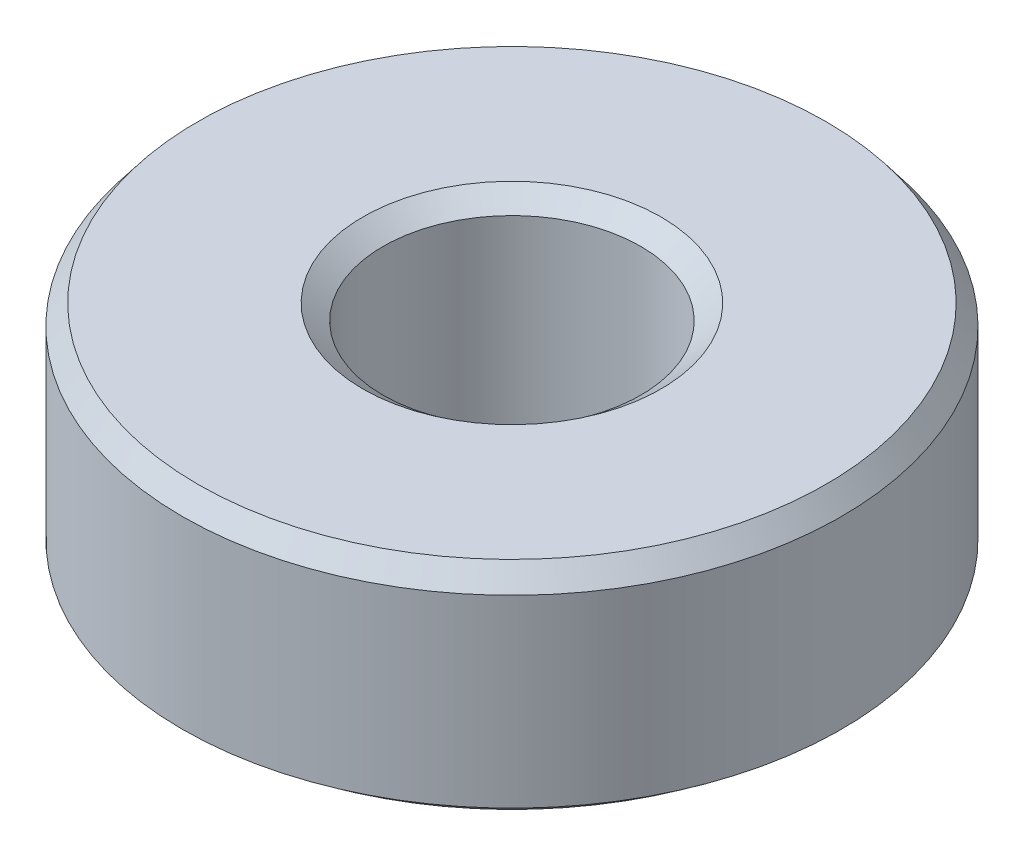
ISO-10303-21;
HEADER;
FILE_DESCRIPTION(('STEP AP214'),'2;1');
FILE_NAME('part.step','',(''),(''),'','','');
FILE_SCHEMA(('AUTOMOTIVE_DESIGN { 1 0 10303 214 1 1 1 1 }'));
ENDSEC;
DATA;
#1=APPLICATION_CONTEXT('core data for automotive mechanical design processes');
#2=APPLICATION_PROTOCOL_DEFINITION('international standard','automotive_design',2000,#1);
#3=PRODUCT_CONTEXT('',#1,'mechanical');
#4=PRODUCT('Part','Part','',(#3));
#5=PRODUCT_RELATED_PRODUCT_CATEGORY('part','',(#4));
#6=PRODUCT_DEFINITION_FORMATION('','',#4);
#7=PRODUCT_DEFINITION_CONTEXT('part definition',#1,'design');
#8=PRODUCT_DEFINITION('design','',#6,#7);
#9=PRODUCT_DEFINITION_SHAPE('','',#8);
#10=(LENGTH_UNIT() NAMED_UNIT(*) SI_UNIT(.MILLI.,.METRE.));
#11=(NAMED_UNIT(*) PLANE_ANGLE_UNIT() SI_UNIT($,.RADIAN.));
#12=(NAMED_UNIT(*) SI_UNIT($,.STERADIAN.) SOLID_ANGLE_UNIT());
#13=UNCERTAINTY_MEASURE_WITH_UNIT(LENGTH_MEASURE(1.E-05),#10,'distance_accuracy_value','');
#14=(GEOMETRIC_REPRESENTATION_CONTEXT(3) GLOBAL_UNCERTAINTY_ASSIGNED_CONTEXT((#13)) GLOBAL_UNIT_ASSIGNED_CONTEXT((#10,
#11,#12)) REPRESENTATION_CONTEXT('',''));
#15=CARTESIAN_POINT('',(0.,0.,0.));
#16=DIRECTION('',(0.,0.,1.));
#17=DIRECTION('',(1.,0.,0.));
#18=AXIS2_PLACEMENT_3D('',#15,#16,#17);
#19=CARTESIAN_POINT('',(0.,40.0358661543662,0.));
#20=DIRECTION('',(0.,-1.,0.));
#21=DIRECTION('',(0.,0.,-1.));
#22=AXIS2_PLACEMENT_3D('',#19,#20,#21);
#23=CYLINDRICAL_SURFACE('',#22,60.);
#24=CARTESIAN_POINT('',(0.,2.8115073566688,0.));
#25=DIRECTION('',(0.,1.,0.));
#26=DIRECTION('',(0.,0.,1.));
#27=AXIS2_PLACEMENT_3D('',#24,#25,#26);
#28=CIRCLE('',#27,60.);
#29=CARTESIAN_POINT('',(0.,2.8115073566688,60.));
#30=VERTEX_POINT('',#29);
#31=EDGE_CURVE('E10',#30,#30,#28,.T.);
#32=ORIENTED_EDGE('',*,*,#31,.T.);
#33=EDGE_LOOP('',(#32));
#34=FACE_BOUND('',#33,.T.);
#35=CARTESIAN_POINT('',(0.,36.3659177625387,0.));
#36=DIRECTION('',(0.,1.,0.));
#37=DIRECTION('',(0.,0.,1.));
#38=AXIS2_PLACEMENT_3D('',#35,#36,#37);
#39=CIRCLE('',#38,60.);
#40=CARTESIAN_POINT('',(0.,36.3659177625387,60.));
#41=VERTEX_POINT('',#40);
#42=EDGE_CURVE('E50',#41,#41,#39,.F.);
#43=ORIENTED_EDGE('',*,*,#42,.T.);
#44=EDGE_LOOP('',(#43));
#45=FACE_BOUND('',#44,.T.);
#46=ADVANCED_FACE('F39',(#34,#45),#23,.T.);
#47=CARTESIAN_POINT('',(0.,40.0358661543662,0.));
#48=DIRECTION('',(0.,1.,0.));
#49=DIRECTION('',(0.,0.,1.));
#50=AXIS2_PLACEMENT_3D('',#47,#48,#49);
#51=PLANE('',#50);
#52=CARTESIAN_POINT('',(0.,40.0358661543662,0.));
#53=DIRECTION('',(0.,1.,0.));
#54=DIRECTION('',(0.,0.,1.));
#55=AXIS2_PLACEMENT_3D('',#52,#53,#54);
#56=CIRCLE('',#55,27.1388252625554);
#57=CARTESIAN_POINT('',(0.,40.0358661543662,27.1388252625554));
#58=VERTEX_POINT('',#57);
#59=EDGE_CURVE('E58',#58,#58,#56,.F.);
#60=ORIENTED_EDGE('',*,*,#59,.T.);
#61=EDGE_LOOP('',(#60));
#62=FACE_BOUND('',#61,.T.);
#63=CARTESIAN_POINT('',(0.,40.0358661543662,0.));
#64=DIRECTION('',(0.,1.,0.));
#65=DIRECTION('',(0.,0.,1.));
#66=AXIS2_PLACEMENT_3D('',#63,#64,#65);
#67=CIRCLE('',#66,57.1884926433312);
#68=CARTESIAN_POINT('',(0.,40.0358661543662,57.1884926433312));
#69=VERTEX_POINT('',#68);
#70=EDGE_CURVE('E61',#69,#69,#67,.T.);
#71=ORIENTED_EDGE('',*,*,#70,.T.);
#72=EDGE_LOOP('',(#71));
#73=FACE_BOUND('',#72,.T.);
#74=ADVANCED_FACE('F88',(#62,#73),#51,.T.);
#75=CARTESIAN_POINT('',(0.,0.,0.));
#76=DIRECTION('',(0.,1.,0.));
#77=DIRECTION('',(0.,0.,1.));
#78=AXIS2_PLACEMENT_3D('',#75,#76,#77);
#79=PLANE('',#78);
#80=CARTESIAN_POINT('',(0.,0.,0.));
#81=DIRECTION('',(0.,1.,0.));
#82=DIRECTION('',(0.,0.,1.));
#83=AXIS2_PLACEMENT_3D('',#80,#81,#82);
#84=CIRCLE('',#83,26.2803842273968);
#85=CARTESIAN_POINT('',(0.,0.,26.2803842273968));
#86=VERTEX_POINT('',#85);
#87=EDGE_CURVE('E51',#86,#86,#84,.T.);
#88=ORIENTED_EDGE('',*,*,#87,.T.);
#89=EDGE_LOOP('',(#88));
#90=FACE_BOUND('',#89,.T.);
#91=CARTESIAN_POINT('',(0.,0.,0.));
#92=DIRECTION('',(0.,1.,0.));
#93=DIRECTION('',(0.,0.,1.));
#94=AXIS2_PLACEMENT_3D('',#91,#92,#93);
#95=CIRCLE('',#94,56.3300516081726);
#96=CARTESIAN_POINT('',(0.,0.,56.3300516081726));
#97=VERTEX_POINT('',#96);
#98=EDGE_CURVE('E54',#97,#97,#95,.F.);
#99=ORIENTED_EDGE('',*,*,#98,.T.);
#100=EDGE_LOOP('',(#99));
#101=FACE_BOUND('',#100,.T.);
#102=ADVANCED_FACE('F83',(#90,#101),#79,.F.);
#103=CARTESIAN_POINT('',(0.,40.0358661543662,0.));
#104=DIRECTION('',(0.,-1.,0.));
#105=DIRECTION('',(0.,0.,-1.));
#106=AXIS2_PLACEMENT_3D('',#103,#104,#105);
#107=CYLINDRICAL_SURFACE('',#106,23.468876870728);
#108=CARTESIAN_POINT('',(0.,37.2243587976974,0.));
#109=DIRECTION('',(0.,1.,0.));
#110=DIRECTION('',(0.,0.,1.));
#111=AXIS2_PLACEMENT_3D('',#108,#109,#110);
#112=CIRCLE('',#111,23.468876870728);
#113=CARTESIAN_POINT('',(0.,37.2243587976974,23.468876870728));
#114=VERTEX_POINT('',#113);
#115=EDGE_CURVE('E67',#114,#114,#112,.T.);
#116=ORIENTED_EDGE('',*,*,#115,.T.);
#117=EDGE_LOOP('',(#116));
#118=FACE_BOUND('',#117,.T.);
#119=CARTESIAN_POINT('',(0.,3.66994839182737,0.));
#120=DIRECTION('',(0.,1.,0.));
#121=DIRECTION('',(0.,0.,1.));
#122=AXIS2_PLACEMENT_3D('',#119,#120,#121);
#123=CIRCLE('',#122,23.468876870728);
#124=CARTESIAN_POINT('',(0.,3.66994839182737,23.468876870728));
#125=VERTEX_POINT('',#124);
#126=EDGE_CURVE('E69',#125,#125,#123,.F.);
#127=ORIENTED_EDGE('',*,*,#126,.T.);
#128=EDGE_LOOP('',(#127));
#129=FACE_BOUND('',#128,.T.);
#130=ADVANCED_FACE('F71',(#118,#129),#107,.F.);
#131=CARTESIAN_POINT('',(0.,37.2243587976974,0.));
#132=DIRECTION('',(0.,1.,0.));
#133=DIRECTION('',(0.,0.,1.));
#134=AXIS2_PLACEMENT_3D('',#131,#132,#133);
#135=CONICAL_SURFACE('',#134,23.468876870728,0.917077479546447);
#136=ORIENTED_EDGE('',*,*,#59,.F.);
#137=EDGE_LOOP('',(#136));
#138=FACE_BOUND('',#137,.T.);
#139=ORIENTED_EDGE('',*,*,#115,.F.);
#140=EDGE_LOOP('',(#139));
#141=FACE_BOUND('',#140,.T.);
#142=ADVANCED_FACE('F77',(#138,#141),#135,.F.);
#143=CARTESIAN_POINT('',(0.,0.,0.));
#144=DIRECTION('',(0.,-1.,0.));
#145=DIRECTION('',(0.,0.,-1.));
#146=AXIS2_PLACEMENT_3D('',#143,#144,#145);
#147=CONICAL_SURFACE('',#146,26.2803842273968,0.653718847248447);
#148=ORIENTED_EDGE('',*,*,#126,.F.);
#149=EDGE_LOOP('',(#148));
#150=FACE_BOUND('',#149,.T.);
#151=ORIENTED_EDGE('',*,*,#87,.F.);
#152=EDGE_LOOP('',(#151));
#153=FACE_BOUND('',#152,.T.);
#154=ADVANCED_FACE('F73',(#150,#153),#147,.F.);
#155=CARTESIAN_POINT('',(0.,2.8115073566688,0.));
#156=DIRECTION('',(0.,1.,0.));
#157=DIRECTION('',(0.,0.,1.));
#158=AXIS2_PLACEMENT_3D('',#155,#156,#157);
#159=CONICAL_SURFACE('',#158,60.,0.917077479546448);
#160=ORIENTED_EDGE('',*,*,#98,.F.);
#161=EDGE_LOOP('',(#160));
#162=FACE_BOUND('',#161,.T.);
#163=ORIENTED_EDGE('',*,*,#31,.F.);
#164=EDGE_LOOP('',(#163));
#165=FACE_BOUND('',#164,.T.);
#166=ADVANCED_FACE('F76',(#162,#165),#159,.T.);
#167=CARTESIAN_POINT('',(0.,40.0358661543662,0.));
#168=DIRECTION('',(0.,-1.,0.));
#169=DIRECTION('',(0.,0.,-1.));
#170=AXIS2_PLACEMENT_3D('',#167,#168,#169);
#171=CONICAL_SURFACE('',#170,57.1884926433312,0.653718847248448);
#172=ORIENTED_EDGE('',*,*,#42,.F.);
#173=EDGE_LOOP('',(#172));
#174=FACE_BOUND('',#173,.T.);
#175=ORIENTED_EDGE('',*,*,#70,.F.);
#176=EDGE_LOOP('',(#175));
#177=FACE_BOUND('',#176,.T.);
#178=ADVANCED_FACE('F45',(#174,#177),#171,.T.);
#179=CLOSED_SHELL('',(#46,#74,#102,#130,#142,#154,#166,#178));
#180=MANIFOLD_SOLID_BREP('B2',#179);
#181=ADVANCED_BREP_SHAPE_REPRESENTATION('',(#18,#180),#14);
#182=SHAPE_DEFINITION_REPRESENTATION(#9,#181);
ENDSEC;
END-ISO-10303-21;
